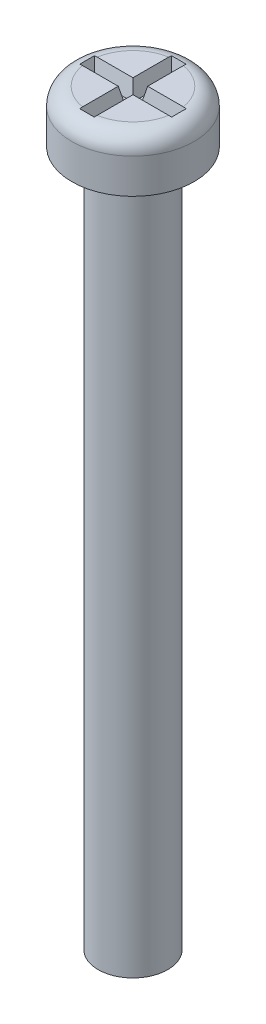
ISO-10303-21;
HEADER;
FILE_DESCRIPTION(('STEP AP214'),'2;1');
FILE_NAME('part.step','',(''),(''),'','','');
FILE_SCHEMA(('AUTOMOTIVE_DESIGN { 1 0 10303 214 1 1 1 1 }'));
ENDSEC;
DATA;
#1=APPLICATION_CONTEXT('core data for automotive mechanical design processes');
#2=APPLICATION_PROTOCOL_DEFINITION('international standard','automotive_design',2000,#1);
#3=PRODUCT_CONTEXT('',#1,'mechanical');
#4=PRODUCT('Part','Part','',(#3));
#5=PRODUCT_RELATED_PRODUCT_CATEGORY('part','',(#4));
#6=PRODUCT_DEFINITION_FORMATION('','',#4);
#7=PRODUCT_DEFINITION_CONTEXT('part definition',#1,'design');
#8=PRODUCT_DEFINITION('design','',#6,#7);
#9=PRODUCT_DEFINITION_SHAPE('','',#8);
#10=(LENGTH_UNIT() NAMED_UNIT(*) SI_UNIT(.MILLI.,.METRE.));
#11=(NAMED_UNIT(*) PLANE_ANGLE_UNIT() SI_UNIT($,.RADIAN.));
#12=(NAMED_UNIT(*) SI_UNIT($,.STERADIAN.) SOLID_ANGLE_UNIT());
#13=UNCERTAINTY_MEASURE_WITH_UNIT(LENGTH_MEASURE(1.E-05),#10,'distance_accuracy_value','');
#14=(GEOMETRIC_REPRESENTATION_CONTEXT(3) GLOBAL_UNCERTAINTY_ASSIGNED_CONTEXT((#13)) GLOBAL_UNIT_ASSIGNED_CONTEXT((#10,
#11,#12)) REPRESENTATION_CONTEXT('',''));
#15=CARTESIAN_POINT('',(0.,0.,0.));
#16=DIRECTION('',(0.,0.,1.));
#17=DIRECTION('',(1.,0.,0.));
#18=AXIS2_PLACEMENT_3D('',#15,#16,#17);
#19=CARTESIAN_POINT('',(0.,43.,0.));
#20=DIRECTION('',(0.,1.,0.));
#21=DIRECTION('',(0.,0.,1.));
#22=AXIS2_PLACEMENT_3D('',#19,#20,#21);
#23=PLANE('',#22);
#24=DIRECTION('',(-1.,0.,0.));
#25=VECTOR('',#24,1.);
#26=CARTESIAN_POINT('',(0.422769915905619,43.,-0.422769915905619));
#27=LINE('',#26,#25);
#28=CARTESIAN_POINT('',(2.47921168886506,43.,-0.422769915905619));
#29=VERTEX_POINT('',#28);
#30=CARTESIAN_POINT('',(0.422769915905619,43.,-0.422769915905619));
#31=VERTEX_POINT('',#30);
#32=EDGE_CURVE('E376',#29,#31,#27,.T.);
#33=ORIENTED_EDGE('',*,*,#32,.F.);
#34=CARTESIAN_POINT('',(0.,43.,0.));
#35=DIRECTION('',(0.,1.,0.));
#36=DIRECTION('',(0.,0.,1.));
#37=AXIS2_PLACEMENT_3D('',#34,#35,#36);
#38=CIRCLE('',#37,2.515);
#39=CARTESIAN_POINT('',(0.422769915905619,43.,-2.47921168886506));
#40=VERTEX_POINT('',#39);
#41=EDGE_CURVE('E262',#29,#40,#38,.T.);
#42=ORIENTED_EDGE('',*,*,#41,.T.);
#43=DIRECTION('',(0.,0.,-1.));
#44=VECTOR('',#43,1.);
#45=CARTESIAN_POINT('',(0.422769915905619,43.,-2.64154947271322));
#46=LINE('',#45,#44);
#47=EDGE_CURVE('E161',#31,#40,#46,.T.);
#48=ORIENTED_EDGE('',*,*,#47,.F.);
#49=EDGE_LOOP('',(#33,#42,#48));
#50=FACE_BOUND('',#49,.T.);
#51=ADVANCED_FACE('F34',(#50),#23,.T.);
#52=DIRECTION('',(0.,0.,1.));
#53=VECTOR('',#52,1.);
#54=CARTESIAN_POINT('',(-0.422769915905619,43.,-0.422769915905619));
#55=LINE('',#54,#53);
#56=CARTESIAN_POINT('',(-0.422769915905619,43.,-2.47921168886506));
#57=VERTEX_POINT('',#56);
#58=CARTESIAN_POINT('',(-0.422769915905619,43.,-0.422769915905619));
#59=VERTEX_POINT('',#58);
#60=EDGE_CURVE('E148',#57,#59,#55,.T.);
#61=ORIENTED_EDGE('',*,*,#60,.F.);
#62=CARTESIAN_POINT('',(0.,43.,0.));
#63=DIRECTION('',(0.,1.,0.));
#64=DIRECTION('',(0.,0.,1.));
#65=AXIS2_PLACEMENT_3D('',#62,#63,#64);
#66=CIRCLE('',#65,2.515);
#67=CARTESIAN_POINT('',(-2.47921168886506,43.,-0.422769915905619));
#68=VERTEX_POINT('',#67);
#69=EDGE_CURVE('E174',#57,#68,#66,.T.);
#70=ORIENTED_EDGE('',*,*,#69,.T.);
#71=DIRECTION('',(-1.,0.,0.));
#72=VECTOR('',#71,1.);
#73=CARTESIAN_POINT('',(-2.64154947271322,43.,-0.422769915905619));
#74=LINE('',#73,#72);
#75=EDGE_CURVE('E160',#59,#68,#74,.T.);
#76=ORIENTED_EDGE('',*,*,#75,.F.);
#77=EDGE_LOOP('',(#61,#70,#76));
#78=FACE_BOUND('',#77,.T.);
#79=ADVANCED_FACE('F173',(#78),#23,.T.);
#80=DIRECTION('',(1.,0.,0.));
#81=VECTOR('',#80,1.);
#82=CARTESIAN_POINT('',(-0.422769915905619,43.,0.422769915905619));
#83=LINE('',#82,#81);
#84=CARTESIAN_POINT('',(-2.47921168886506,43.,0.422769915905619));
#85=VERTEX_POINT('',#84);
#86=CARTESIAN_POINT('',(-0.422769915905619,43.,0.422769915905619));
#87=VERTEX_POINT('',#86);
#88=EDGE_CURVE('E175',#85,#87,#83,.T.);
#89=ORIENTED_EDGE('',*,*,#88,.F.);
#90=CARTESIAN_POINT('',(0.,43.,0.));
#91=DIRECTION('',(0.,1.,0.));
#92=DIRECTION('',(0.,0.,1.));
#93=AXIS2_PLACEMENT_3D('',#90,#91,#92);
#94=CIRCLE('',#93,2.515);
#95=CARTESIAN_POINT('',(-0.422769915905619,43.,2.47921168886506));
#96=VERTEX_POINT('',#95);
#97=EDGE_CURVE('E259',#85,#96,#94,.T.);
#98=ORIENTED_EDGE('',*,*,#97,.T.);
#99=DIRECTION('',(0.,0.,1.));
#100=VECTOR('',#99,1.);
#101=CARTESIAN_POINT('',(-0.422769915905619,43.,2.64154947271322));
#102=LINE('',#101,#100);
#103=EDGE_CURVE('E177',#87,#96,#102,.T.);
#104=ORIENTED_EDGE('',*,*,#103,.F.);
#105=EDGE_LOOP('',(#89,#98,#104));
#106=FACE_BOUND('',#105,.T.);
#107=ADVANCED_FACE('F406',(#106),#23,.T.);
#108=CARTESIAN_POINT('',(0.,40.,0.));
#109=DIRECTION('',(0.,-1.,0.));
#110=DIRECTION('',(0.,0.,-1.));
#111=AXIS2_PLACEMENT_3D('',#108,#109,#110);
#112=CYLINDRICAL_SURFACE('',#111,2.);
#113=CARTESIAN_POINT('',(0.,40.,0.));
#114=DIRECTION('',(0.,1.,0.));
#115=DIRECTION('',(0.,0.,1.));
#116=AXIS2_PLACEMENT_3D('',#113,#114,#115);
#117=CIRCLE('',#116,2.);
#118=CARTESIAN_POINT('',(0.,40.,2.));
#119=VERTEX_POINT('',#118);
#120=EDGE_CURVE('E252',#119,#119,#117,.T.);
#121=ORIENTED_EDGE('',*,*,#120,.F.);
#122=EDGE_LOOP('',(#121));
#123=FACE_BOUND('',#122,.T.);
#124=CARTESIAN_POINT('',(0.,0.,0.));
#125=DIRECTION('',(0.,1.,0.));
#126=DIRECTION('',(0.,0.,1.));
#127=AXIS2_PLACEMENT_3D('',#124,#125,#126);
#128=CIRCLE('',#127,2.);
#129=CARTESIAN_POINT('',(0.,0.,2.));
#130=VERTEX_POINT('',#129);
#131=EDGE_CURVE('E251',#130,#130,#128,.T.);
#132=ORIENTED_EDGE('',*,*,#131,.T.);
#133=EDGE_LOOP('',(#132));
#134=FACE_BOUND('',#133,.T.);
#135=ADVANCED_FACE('F411',(#123,#134),#112,.T.);
#136=CARTESIAN_POINT('',(0.,0.,0.));
#137=DIRECTION('',(0.,1.,0.));
#138=DIRECTION('',(0.,0.,1.));
#139=AXIS2_PLACEMENT_3D('',#136,#137,#138);
#140=PLANE('',#139);
#141=ORIENTED_EDGE('',*,*,#131,.F.);
#142=EDGE_LOOP('',(#141));
#143=FACE_BOUND('',#142,.T.);
#144=ADVANCED_FACE('F416',(#143),#140,.F.);
#145=CARTESIAN_POINT('',(0.,43.,0.));
#146=DIRECTION('',(0.,-1.,0.));
#147=DIRECTION('',(0.,0.,-1.));
#148=AXIS2_PLACEMENT_3D('',#145,#146,#147);
#149=CYLINDRICAL_SURFACE('',#148,3.515);
#150=CARTESIAN_POINT('',(0.,42.,0.));
#151=DIRECTION('',(0.,1.,0.));
#152=DIRECTION('',(0.,0.,1.));
#153=AXIS2_PLACEMENT_3D('',#150,#151,#152);
#154=CIRCLE('',#153,3.515);
#155=CARTESIAN_POINT('',(0.,42.,3.515));
#156=VERTEX_POINT('',#155);
#157=EDGE_CURVE('E11',#156,#156,#154,.F.);
#158=ORIENTED_EDGE('',*,*,#157,.T.);
#159=EDGE_LOOP('',(#158));
#160=FACE_BOUND('',#159,.T.);
#161=CARTESIAN_POINT('',(0.,40.,0.));
#162=DIRECTION('',(0.,1.,0.));
#163=DIRECTION('',(0.,0.,1.));
#164=AXIS2_PLACEMENT_3D('',#161,#162,#163);
#165=CIRCLE('',#164,3.515);
#166=CARTESIAN_POINT('',(0.,40.,3.515));
#167=VERTEX_POINT('',#166);
#168=EDGE_CURVE('E190',#167,#167,#165,.T.);
#169=ORIENTED_EDGE('',*,*,#168,.T.);
#170=EDGE_LOOP('',(#169));
#171=FACE_BOUND('',#170,.T.);
#172=ADVANCED_FACE('F420',(#160,#171),#149,.T.);
#173=DIRECTION('',(0.,0.,-1.));
#174=VECTOR('',#173,1.);
#175=CARTESIAN_POINT('',(0.422769915905619,43.,0.422769915905619));
#176=LINE('',#175,#174);
#177=CARTESIAN_POINT('',(0.422769915905619,43.,2.47921168886506));
#178=VERTEX_POINT('',#177);
#179=CARTESIAN_POINT('',(0.422769915905619,43.,0.422769915905619));
#180=VERTEX_POINT('',#179);
#181=EDGE_CURVE('E183',#178,#180,#176,.T.);
#182=ORIENTED_EDGE('',*,*,#181,.F.);
#183=CARTESIAN_POINT('',(0.,43.,0.));
#184=DIRECTION('',(0.,1.,0.));
#185=DIRECTION('',(0.,0.,1.));
#186=AXIS2_PLACEMENT_3D('',#183,#184,#185);
#187=CIRCLE('',#186,2.515);
#188=CARTESIAN_POINT('',(2.47921168886506,43.,0.422769915905619));
#189=VERTEX_POINT('',#188);
#190=EDGE_CURVE('E255',#178,#189,#187,.T.);
#191=ORIENTED_EDGE('',*,*,#190,.T.);
#192=DIRECTION('',(1.,0.,0.));
#193=VECTOR('',#192,1.);
#194=CARTESIAN_POINT('',(2.64154947271322,43.,0.422769915905619));
#195=LINE('',#194,#193);
#196=EDGE_CURVE('E185',#180,#189,#195,.T.);
#197=ORIENTED_EDGE('',*,*,#196,.F.);
#198=EDGE_LOOP('',(#182,#191,#197));
#199=FACE_BOUND('',#198,.T.);
#200=ADVANCED_FACE('F365',(#199),#23,.T.);
#201=CARTESIAN_POINT('',(0.,40.,0.));
#202=DIRECTION('',(0.,1.,0.));
#203=DIRECTION('',(0.,0.,1.));
#204=AXIS2_PLACEMENT_3D('',#201,#202,#203);
#205=PLANE('',#204);
#206=ORIENTED_EDGE('',*,*,#120,.T.);
#207=EDGE_LOOP('',(#206));
#208=FACE_BOUND('',#207,.T.);
#209=ORIENTED_EDGE('',*,*,#168,.F.);
#210=EDGE_LOOP('',(#209));
#211=FACE_BOUND('',#210,.T.);
#212=ADVANCED_FACE('F419',(#208,#211),#205,.F.);
#213=CARTESIAN_POINT('',(0.422769915905619,43.,-0.422769915905619));
#214=DIRECTION('',(0.,-0.207911690817759,-0.978147600733806));
#215=DIRECTION('',(0.,0.978147600733806,-0.207911690817759));
#216=AXIS2_PLACEMENT_3D('',#213,#214,#215);
#217=PLANE('',#216);
#218=DIRECTION('',(0.203558594952779,0.957667894857973,-0.203558594952779));
#219=VECTOR('',#218,1.);
#220=CARTESIAN_POINT('',(2.60651359835308,42.8351691705733,-0.387734041545471));
#221=LINE('',#220,#219);
#222=CARTESIAN_POINT('',(2.4289929110432,42.,-0.210213354235596));
#223=VERTEX_POINT('',#222);
#224=CARTESIAN_POINT('',(2.63890864587035,42.9875758865211,-0.420129089062744));
#225=VERTEX_POINT('',#224);
#226=EDGE_CURVE('E188',#223,#225,#221,.T.);
#227=ORIENTED_EDGE('',*,*,#226,.T.);
#228=CARTESIAN_POINT('',(2.63890864587035,42.9875758865211,-0.420129089062744));
#229=CARTESIAN_POINT('',(2.61246025382318,42.9917103029364,-0.421007886400498));
#230=CARTESIAN_POINT('',(2.58592795776817,42.9948128539393,-0.421667353974071));
#231=CARTESIAN_POINT('',(2.53269563825816,42.9989542188483,-0.422547628259755));
#232=CARTESIAN_POINT('',(2.50599561531141,42.9999930390051,-0.422768436300485));
#233=CARTESIAN_POINT('',(2.47921168886509,43.0000000000002,-0.422769915905651));
#234=B_SPLINE_CURVE_WITH_KNOTS('',3,(#228,#229,#230,#231,#232,#233),.UNSPECIFIED.,.F.,.F.,(4,2,
4),(0.,0.0801636519091331,0.160327061016982),.UNSPECIFIED.);
#235=EDGE_CURVE('E43',#225,#29,#234,.T.);
#236=ORIENTED_EDGE('',*,*,#235,.T.);
#237=ORIENTED_EDGE('',*,*,#32,.T.);
#238=DIRECTION('',(0.203558594952779,0.957667894857973,-0.203558594952779));
#239=VECTOR('',#238,1.);
#240=CARTESIAN_POINT('',(0.514707491003239,43.4325322839967,-0.514707491003239));
#241=LINE('',#240,#239);
#242=CARTESIAN_POINT('',(0.210213354235596,42.,-0.210213354235596));
#243=VERTEX_POINT('',#242);
#244=EDGE_CURVE('E192',#243,#31,#241,.T.);
#245=ORIENTED_EDGE('',*,*,#244,.F.);
#246=DIRECTION('',(-1.,0.,0.));
#247=VECTOR('',#246,1.);
#248=CARTESIAN_POINT('',(0.,42.,-0.210213354235596));
#249=LINE('',#248,#247);
#250=EDGE_CURVE('E187',#223,#243,#249,.T.);
#251=ORIENTED_EDGE('',*,*,#250,.F.);
#252=EDGE_LOOP('',(#227,#236,#237,#245,#251));
#253=FACE_BOUND('',#252,.T.);
#254=ADVANCED_FACE('F284',(#253),#217,.F.);
#255=CARTESIAN_POINT('',(2.64154947271322,43.,0.422769915905619));
#256=DIRECTION('',(0.978147600733806,-0.207911690817759,0.));
#257=DIRECTION('',(0.207911690817759,0.978147600733806,0.));
#258=AXIS2_PLACEMENT_3D('',#255,#256,#257);
#259=PLANE('',#258);
#260=DIRECTION('',(0.203558594952779,0.957667894857973,0.203558594952779));
#261=VECTOR('',#260,1.);
#262=CARTESIAN_POINT('',(2.64154947271322,43.,0.422769915905619));
#263=LINE('',#262,#261);
#264=CARTESIAN_POINT('',(2.4289929110432,42.,0.210213354235596));
#265=VERTEX_POINT('',#264);
#266=CARTESIAN_POINT('',(2.63890864587035,42.9875758865211,0.420129089062743));
#267=VERTEX_POINT('',#266);
#268=EDGE_CURVE('E191',#265,#267,#263,.T.);
#269=ORIENTED_EDGE('',*,*,#268,.T.);
#270=CARTESIAN_POINT('',(2.63890864587035,42.9875758865211,0.420129089062743));
#271=CARTESIAN_POINT('',(2.63926052612753,42.989231352974,0.350115794791615));
#272=CARTESIAN_POINT('',(2.63950472425311,42.9903802148282,0.280093037473653));
#273=CARTESIAN_POINT('',(2.63981715218977,42.9918500727061,0.140046852645141));
#274=CARTESIAN_POINT('',(2.6398854040906,42.9921711726538,0.0700234263225704));
#275=CARTESIAN_POINT('',(2.6398854040906,42.9921711726538,-0.070023426322571));
#276=CARTESIAN_POINT('',(2.63981715218977,42.9918500727061,-0.140046852645142));
#277=CARTESIAN_POINT('',(2.63950472425311,42.9903802148282,-0.280093037473653));
#278=CARTESIAN_POINT('',(2.63926052612753,42.989231352974,-0.350115794791616));
#279=CARTESIAN_POINT('',(2.63890864587035,42.9875758865211,-0.420129089062744));
#280=B_SPLINE_CURVE_WITH_KNOTS('',3,(#270,#271,#272,#273,#274,#275,#276,#277,#278,#279),
.UNSPECIFIED.,.F.,.F.,(4,2,2,2,4),(0.,0.210094701314381,0.420163024312075,0.630231347309768,
0.840326048624149),.UNSPECIFIED.);
#281=EDGE_CURVE('E50',#267,#225,#280,.T.);
#282=ORIENTED_EDGE('',*,*,#281,.T.);
#283=ORIENTED_EDGE('',*,*,#226,.F.);
#284=DIRECTION('',(0.,0.,-1.));
#285=VECTOR('',#284,1.);
#286=CARTESIAN_POINT('',(2.4289929110432,42.,0.));
#287=LINE('',#286,#285);
#288=EDGE_CURVE('E196',#265,#223,#287,.T.);
#289=ORIENTED_EDGE('',*,*,#288,.F.);
#290=EDGE_LOOP('',(#269,#282,#283,#289));
#291=FACE_BOUND('',#290,.T.);
#292=ADVANCED_FACE('F361',(#291),#259,.F.);
#293=CARTESIAN_POINT('',(2.64154947271322,43.,0.422769915905619));
#294=DIRECTION('',(0.,-0.207911690817759,0.978147600733806));
#295=DIRECTION('',(0.,-0.978147600733806,-0.207911690817759));
#296=AXIS2_PLACEMENT_3D('',#293,#294,#295);
#297=PLANE('',#296);
#298=ORIENTED_EDGE('',*,*,#196,.T.);
#299=CARTESIAN_POINT('',(2.47921168886506,43.,0.422769915905619));
#300=CARTESIAN_POINT('',(2.5059956153114,42.9999930390051,0.422768436300468));
#301=CARTESIAN_POINT('',(2.53269563825815,42.9989542188483,0.422547628259749));
#302=CARTESIAN_POINT('',(2.58592795776817,42.9948128539393,0.421667353974077));
#303=CARTESIAN_POINT('',(2.61246025382318,42.9917103029365,0.421007886400505));
#304=CARTESIAN_POINT('',(2.63890864587035,42.9875758865211,0.420129089062746));
#305=B_SPLINE_CURVE_WITH_KNOTS('',3,(#299,#300,#301,#302,#303,#304),.UNSPECIFIED.,.F.,.F.,(4,2,
4),(0.,0.0801634091078601,0.160327061016998),.UNSPECIFIED.);
#306=EDGE_CURVE('E58',#189,#267,#305,.T.);
#307=ORIENTED_EDGE('',*,*,#306,.T.);
#308=ORIENTED_EDGE('',*,*,#268,.F.);
#309=DIRECTION('',(1.,0.,0.));
#310=VECTOR('',#309,1.);
#311=CARTESIAN_POINT('',(0.,42.,0.210213354235596));
#312=LINE('',#311,#310);
#313=CARTESIAN_POINT('',(0.210213354235596,42.,0.210213354235596));
#314=VERTEX_POINT('',#313);
#315=EDGE_CURVE('E223',#314,#265,#312,.T.);
#316=ORIENTED_EDGE('',*,*,#315,.F.);
#317=DIRECTION('',(0.203558594952779,0.957667894857973,0.203558594952779));
#318=VECTOR('',#317,1.);
#319=CARTESIAN_POINT('',(0.514707491003239,43.4325322839967,0.514707491003239));
#320=LINE('',#319,#318);
#321=EDGE_CURVE('E214',#314,#180,#320,.T.);
#322=ORIENTED_EDGE('',*,*,#321,.T.);
#323=EDGE_LOOP('',(#298,#307,#308,#316,#322));
#324=FACE_BOUND('',#323,.T.);
#325=ADVANCED_FACE('F356',(#324),#297,.F.);
#326=CARTESIAN_POINT('',(0.422769915905619,43.,0.422769915905619));
#327=DIRECTION('',(0.978147600733806,-0.207911690817759,0.));
#328=DIRECTION('',(0.207911690817759,0.978147600733806,0.));
#329=AXIS2_PLACEMENT_3D('',#326,#327,#328);
#330=PLANE('',#329);
#331=DIRECTION('',(0.203558594952779,0.957667894857973,0.203558594952779));
#332=VECTOR('',#331,1.);
#333=CARTESIAN_POINT('',(0.387734041545471,42.8351691705733,2.60651359835307));
#334=LINE('',#333,#332);
#335=CARTESIAN_POINT('',(0.210213354235596,42.,2.4289929110432));
#336=VERTEX_POINT('',#335);
#337=CARTESIAN_POINT('',(0.420129089062744,42.9875758865211,2.63890864587035));
#338=VERTEX_POINT('',#337);
#339=EDGE_CURVE('E211',#336,#338,#334,.T.);
#340=ORIENTED_EDGE('',*,*,#339,.T.);
#341=CARTESIAN_POINT('',(0.420129089062744,42.9875758865211,2.63890864587035));
#342=CARTESIAN_POINT('',(0.421007886400498,42.9917103029364,2.61246025382318));
#343=CARTESIAN_POINT('',(0.421667353974071,42.9948128539393,2.58592795776817));
#344=CARTESIAN_POINT('',(0.422547628259755,42.9989542188483,2.53269563825816));
#345=CARTESIAN_POINT('',(0.422768436300485,42.9999930390051,2.50599561531141));
#346=CARTESIAN_POINT('',(0.422769915905651,43.0000000000002,2.47921168886509));
#347=B_SPLINE_CURVE_WITH_KNOTS('',3,(#341,#342,#343,#344,#345,#346),.UNSPECIFIED.,.F.,.F.,(4,2,
4),(0.,0.0801636519091327,0.160327061016981),.UNSPECIFIED.);
#348=EDGE_CURVE('E343',#338,#178,#347,.T.);
#349=ORIENTED_EDGE('',*,*,#348,.T.);
#350=ORIENTED_EDGE('',*,*,#181,.T.);
#351=ORIENTED_EDGE('',*,*,#321,.F.);
#352=DIRECTION('',(0.,0.,-1.));
#353=VECTOR('',#352,1.);
#354=CARTESIAN_POINT('',(0.210213354235596,42.,0.));
#355=LINE('',#354,#353);
#356=EDGE_CURVE('E226',#336,#314,#355,.T.);
#357=ORIENTED_EDGE('',*,*,#356,.F.);
#358=EDGE_LOOP('',(#340,#349,#350,#351,#357));
#359=FACE_BOUND('',#358,.T.);
#360=ADVANCED_FACE('F353',(#359),#330,.F.);
#361=CARTESIAN_POINT('',(-0.422769915905619,43.,2.64154947271322));
#362=DIRECTION('',(0.,-0.207911690817759,0.978147600733806));
#363=DIRECTION('',(0.,-0.978147600733806,-0.207911690817759));
#364=AXIS2_PLACEMENT_3D('',#361,#362,#363);
#365=PLANE('',#364);
#366=DIRECTION('',(-0.203558594952779,0.957667894857973,0.203558594952779));
#367=VECTOR('',#366,1.);
#368=CARTESIAN_POINT('',(-0.422769915905619,43.,2.64154947271322));
#369=LINE('',#368,#367);
#370=CARTESIAN_POINT('',(-0.210213354235597,42.,2.4289929110432));
#371=VERTEX_POINT('',#370);
#372=CARTESIAN_POINT('',(-0.420129089062743,42.9875758865211,2.63890864587035));
#373=VERTEX_POINT('',#372);
#374=EDGE_CURVE('E208',#371,#373,#369,.T.);
#375=ORIENTED_EDGE('',*,*,#374,.T.);
#376=CARTESIAN_POINT('',(-0.420129089062743,42.9875758865211,2.63890864587035));
#377=CARTESIAN_POINT('',(-0.350115794791616,42.989231352974,2.63926052612753));
#378=CARTESIAN_POINT('',(-0.280093037473653,42.9903802148282,2.63950472425311));
#379=CARTESIAN_POINT('',(-0.140046852645141,42.9918500727061,2.63981715218977));
#380=CARTESIAN_POINT('',(-0.0700234263225707,42.9921711726538,2.6398854040906));
#381=CARTESIAN_POINT('',(0.0700234263225709,42.9921711726538,2.6398854040906));
#382=CARTESIAN_POINT('',(0.140046852645142,42.9918500727061,2.63981715218977));
#383=CARTESIAN_POINT('',(0.280093037473653,42.9903802148282,2.63950472425311));
#384=CARTESIAN_POINT('',(0.350115794791616,42.989231352974,2.63926052612753));
#385=CARTESIAN_POINT('',(0.420129089062744,42.9875758865211,2.63890864587035));
#386=B_SPLINE_CURVE_WITH_KNOTS('',3,(#376,#377,#378,#379,#380,#381,#382,#383,#384,#385),
.UNSPECIFIED.,.F.,.F.,(4,2,2,2,4),(0.,0.210094701314381,0.420163024312075,0.630231347309769,
0.84032604862415),.UNSPECIFIED.);
#387=EDGE_CURVE('E338',#373,#338,#386,.T.);
#388=ORIENTED_EDGE('',*,*,#387,.T.);
#389=ORIENTED_EDGE('',*,*,#339,.F.);
#390=DIRECTION('',(1.,0.,0.));
#391=VECTOR('',#390,1.);
#392=CARTESIAN_POINT('',(0.,42.,2.4289929110432));
#393=LINE('',#392,#391);
#394=EDGE_CURVE('E229',#371,#336,#393,.T.);
#395=ORIENTED_EDGE('',*,*,#394,.F.);
#396=EDGE_LOOP('',(#375,#388,#389,#395));
#397=FACE_BOUND('',#396,.T.);
#398=ADVANCED_FACE('F329',(#397),#365,.F.);
#399=CARTESIAN_POINT('',(-0.422769915905619,43.,2.64154947271322));
#400=DIRECTION('',(-0.978147600733806,-0.207911690817759,0.));
#401=DIRECTION('',(0.207911690817759,-0.978147600733806,0.));
#402=AXIS2_PLACEMENT_3D('',#399,#400,#401);
#403=PLANE('',#402);
#404=ORIENTED_EDGE('',*,*,#103,.T.);
#405=CARTESIAN_POINT('',(-0.422769915905619,43.,2.47921168886506));
#406=CARTESIAN_POINT('',(-0.422768436300468,42.9999930390051,2.5059956153114));
#407=CARTESIAN_POINT('',(-0.422547628259749,42.9989542188483,2.53269563825815));
#408=CARTESIAN_POINT('',(-0.421667353974077,42.9948128539393,2.58592795776817));
#409=CARTESIAN_POINT('',(-0.421007886400505,42.9917103029365,2.61246025382318));
#410=CARTESIAN_POINT('',(-0.420129089062746,42.9875758865211,2.63890864587035));
#411=B_SPLINE_CURVE_WITH_KNOTS('',3,(#405,#406,#407,#408,#409,#410),.UNSPECIFIED.,.F.,.F.,(4,2,
4),(0.,0.0801634091078601,0.160327061016998),.UNSPECIFIED.);
#412=EDGE_CURVE('E333',#96,#373,#411,.T.);
#413=ORIENTED_EDGE('',*,*,#412,.T.);
#414=ORIENTED_EDGE('',*,*,#374,.F.);
#415=DIRECTION('',(0.,0.,1.));
#416=VECTOR('',#415,1.);
#417=CARTESIAN_POINT('',(-0.210213354235596,42.,0.));
#418=LINE('',#417,#416);
#419=CARTESIAN_POINT('',(-0.210213354235596,42.,0.210213354235596));
#420=VERTEX_POINT('',#419);
#421=EDGE_CURVE('E232',#420,#371,#418,.T.);
#422=ORIENTED_EDGE('',*,*,#421,.F.);
#423=DIRECTION('',(-0.203558594952779,0.957667894857973,0.203558594952779));
#424=VECTOR('',#423,1.);
#425=CARTESIAN_POINT('',(-0.514707491003239,43.4325322839967,0.514707491003239));
#426=LINE('',#425,#424);
#427=EDGE_CURVE('E205',#420,#87,#426,.T.);
#428=ORIENTED_EDGE('',*,*,#427,.T.);
#429=EDGE_LOOP('',(#404,#413,#414,#422,#428));
#430=FACE_BOUND('',#429,.T.);
#431=ADVANCED_FACE('F324',(#430),#403,.F.);
#432=CARTESIAN_POINT('',(-0.422769915905619,43.,0.422769915905619));
#433=DIRECTION('',(0.,-0.207911690817759,0.978147600733806));
#434=DIRECTION('',(0.,-0.978147600733806,-0.207911690817759));
#435=AXIS2_PLACEMENT_3D('',#432,#433,#434);
#436=PLANE('',#435);
#437=DIRECTION('',(-0.203558594952779,0.957667894857973,0.203558594952779));
#438=VECTOR('',#437,1.);
#439=CARTESIAN_POINT('',(-2.64154947271322,43.,0.422769915905619));
#440=LINE('',#439,#438);
#441=CARTESIAN_POINT('',(-2.4289929110432,42.,0.210213354235596));
#442=VERTEX_POINT('',#441);
#443=CARTESIAN_POINT('',(-2.63890864587035,42.9875758865211,0.420129089062743));
#444=VERTEX_POINT('',#443);
#445=EDGE_CURVE('E202',#442,#444,#440,.T.);
#446=ORIENTED_EDGE('',*,*,#445,.T.);
#447=CARTESIAN_POINT('',(-2.63890864587035,42.9875758865211,0.420129089062743));
#448=CARTESIAN_POINT('',(-2.61246025382318,42.9917103029364,0.421007886400498));
#449=CARTESIAN_POINT('',(-2.58592795776817,42.9948128539393,0.421667353974071));
#450=CARTESIAN_POINT('',(-2.53269563825816,42.9989542188483,0.422547628259755));
#451=CARTESIAN_POINT('',(-2.50599561531141,42.9999930390051,0.422768436300485));
#452=CARTESIAN_POINT('',(-2.47921168886509,43.0000000000002,0.422769915905651));
#453=B_SPLINE_CURVE_WITH_KNOTS('',3,(#447,#448,#449,#450,#451,#452),.UNSPECIFIED.,.F.,.F.,(4,2,
4),(0.,0.0801636519091327,0.160327061016981),.UNSPECIFIED.);
#454=EDGE_CURVE('E310',#444,#85,#453,.T.);
#455=ORIENTED_EDGE('',*,*,#454,.T.);
#456=ORIENTED_EDGE('',*,*,#88,.T.);
#457=ORIENTED_EDGE('',*,*,#427,.F.);
#458=DIRECTION('',(1.,0.,0.));
#459=VECTOR('',#458,1.);
#460=CARTESIAN_POINT('',(0.,42.,0.210213354235596));
#461=LINE('',#460,#459);
#462=EDGE_CURVE('E235',#442,#420,#461,.T.);
#463=ORIENTED_EDGE('',*,*,#462,.F.);
#464=EDGE_LOOP('',(#446,#455,#456,#457,#463));
#465=FACE_BOUND('',#464,.T.);
#466=ADVANCED_FACE('F319',(#465),#436,.F.);
#467=CARTESIAN_POINT('',(-2.64154947271322,43.,0.422769915905619));
#468=DIRECTION('',(-0.978147600733806,-0.207911690817759,0.));
#469=DIRECTION('',(0.207911690817759,-0.978147600733806,0.));
#470=AXIS2_PLACEMENT_3D('',#467,#468,#469);
#471=PLANE('',#470);
#472=DIRECTION('',(-0.203558594952779,0.957667894857973,-0.203558594952779));
#473=VECTOR('',#472,1.);
#474=CARTESIAN_POINT('',(-2.64154947271322,43.,-0.422769915905619));
#475=LINE('',#474,#473);
#476=CARTESIAN_POINT('',(-2.4289929110432,42.,-0.210213354235596));
#477=VERTEX_POINT('',#476);
#478=CARTESIAN_POINT('',(-2.63890864587035,42.9875758865211,-0.420129089062743));
#479=VERTEX_POINT('',#478);
#480=EDGE_CURVE('E170',#477,#479,#475,.T.);
#481=ORIENTED_EDGE('',*,*,#480,.T.);
#482=CARTESIAN_POINT('',(-2.63890864587035,42.9875758865211,-0.420129089062743));
#483=CARTESIAN_POINT('',(-2.63926052612753,42.989231352974,-0.350115794791615));
#484=CARTESIAN_POINT('',(-2.63950472425311,42.9903802148282,-0.280093037473653));
#485=CARTESIAN_POINT('',(-2.63981715218977,42.9918500727061,-0.140046852645141));
#486=CARTESIAN_POINT('',(-2.6398854040906,42.9921711726538,-0.0700234263225706));
#487=CARTESIAN_POINT('',(-2.6398854040906,42.9921711726538,0.0700234263225706));
#488=CARTESIAN_POINT('',(-2.63981715218977,42.9918500727061,0.140046852645141));
#489=CARTESIAN_POINT('',(-2.63950472425311,42.9903802148282,0.280093037473653));
#490=CARTESIAN_POINT('',(-2.63926052612753,42.989231352974,0.350115794791615));
#491=CARTESIAN_POINT('',(-2.63890864587035,42.9875758865211,0.420129089062743));
#492=B_SPLINE_CURVE_WITH_KNOTS('',3,(#482,#483,#484,#485,#486,#487,#488,#489,#490,#491),
.UNSPECIFIED.,.F.,.F.,(4,2,2,2,4),(0.,0.210094701314381,0.420163024312074,0.630231347309768,
0.840326048624149),.UNSPECIFIED.);
#493=EDGE_CURVE('E305',#479,#444,#492,.T.);
#494=ORIENTED_EDGE('',*,*,#493,.T.);
#495=ORIENTED_EDGE('',*,*,#445,.F.);
#496=DIRECTION('',(0.,0.,1.));
#497=VECTOR('',#496,1.);
#498=CARTESIAN_POINT('',(-2.4289929110432,42.,0.));
#499=LINE('',#498,#497);
#500=EDGE_CURVE('E238',#477,#442,#499,.T.);
#501=ORIENTED_EDGE('',*,*,#500,.F.);
#502=EDGE_LOOP('',(#481,#494,#495,#501));
#503=FACE_BOUND('',#502,.T.);
#504=ADVANCED_FACE('F316',(#503),#471,.F.);
#505=CARTESIAN_POINT('',(-2.64154947271322,43.,-0.422769915905619));
#506=DIRECTION('',(0.,-0.207911690817759,-0.978147600733806));
#507=DIRECTION('',(0.,0.978147600733806,-0.207911690817759));
#508=AXIS2_PLACEMENT_3D('',#505,#506,#507);
#509=PLANE('',#508);
#510=ORIENTED_EDGE('',*,*,#75,.T.);
#511=CARTESIAN_POINT('',(-2.47921168886506,43.,-0.422769915905619));
#512=CARTESIAN_POINT('',(-2.5059956153114,42.9999930390051,-0.422768436300468));
#513=CARTESIAN_POINT('',(-2.53269563825815,42.9989542188483,-0.422547628259749));
#514=CARTESIAN_POINT('',(-2.58592795776817,42.9948128539393,-0.421667353974077));
#515=CARTESIAN_POINT('',(-2.61246025382318,42.9917103029365,-0.421007886400505));
#516=CARTESIAN_POINT('',(-2.63890864587035,42.9875758865211,-0.420129089062746));
#517=B_SPLINE_CURVE_WITH_KNOTS('',3,(#511,#512,#513,#514,#515,#516),.UNSPECIFIED.,.F.,.F.,(4,2,
4),(0.,0.0801634091078601,0.160327061016998),.UNSPECIFIED.);
#518=EDGE_CURVE('E300',#68,#479,#517,.T.);
#519=ORIENTED_EDGE('',*,*,#518,.T.);
#520=ORIENTED_EDGE('',*,*,#480,.F.);
#521=DIRECTION('',(-1.,0.,0.));
#522=VECTOR('',#521,1.);
#523=CARTESIAN_POINT('',(0.,42.,-0.210213354235596));
#524=LINE('',#523,#522);
#525=CARTESIAN_POINT('',(-0.210213354235596,42.,-0.210213354235596));
#526=VERTEX_POINT('',#525);
#527=EDGE_CURVE('E168',#526,#477,#524,.T.);
#528=ORIENTED_EDGE('',*,*,#527,.F.);
#529=DIRECTION('',(-0.203558594952779,0.957667894857973,-0.203558594952779));
#530=VECTOR('',#529,1.);
#531=CARTESIAN_POINT('',(-0.514707491003239,43.4325322839967,-0.514707491003239));
#532=LINE('',#531,#530);
#533=EDGE_CURVE('E153',#526,#59,#532,.T.);
#534=ORIENTED_EDGE('',*,*,#533,.T.);
#535=EDGE_LOOP('',(#510,#519,#520,#528,#534));
#536=FACE_BOUND('',#535,.T.);
#537=ADVANCED_FACE('F165',(#536),#509,.F.);
#538=CARTESIAN_POINT('',(-0.422769915905619,43.,-0.422769915905619));
#539=DIRECTION('',(-0.978147600733806,-0.207911690817759,0.));
#540=DIRECTION('',(0.207911690817759,-0.978147600733806,0.));
#541=AXIS2_PLACEMENT_3D('',#538,#539,#540);
#542=PLANE('',#541);
#543=DIRECTION('',(-0.203558594952779,0.957667894857973,-0.203558594952779));
#544=VECTOR('',#543,1.);
#545=CARTESIAN_POINT('',(-0.422769915905619,43.,-2.64154947271322));
#546=LINE('',#545,#544);
#547=CARTESIAN_POINT('',(-0.210213354235597,42.,-2.4289929110432));
#548=VERTEX_POINT('',#547);
#549=CARTESIAN_POINT('',(-0.420129089062743,42.9875758865211,-2.63890864587035));
#550=VERTEX_POINT('',#549);
#551=EDGE_CURVE('E171',#548,#550,#546,.T.);
#552=ORIENTED_EDGE('',*,*,#551,.T.);
#553=CARTESIAN_POINT('',(-0.420129089062743,42.9875758865211,-2.63890864587035));
#554=CARTESIAN_POINT('',(-0.421007886400498,42.9917103029364,-2.61246025382318));
#555=CARTESIAN_POINT('',(-0.421667353974071,42.9948128539393,-2.58592795776817));
#556=CARTESIAN_POINT('',(-0.422547628259755,42.9989542188483,-2.53269563825816));
#557=CARTESIAN_POINT('',(-0.422768436300485,42.9999930390051,-2.50599561531141));
#558=CARTESIAN_POINT('',(-0.422769915905652,43.0000000000002,-2.47921168886509));
#559=B_SPLINE_CURVE_WITH_KNOTS('',3,(#553,#554,#555,#556,#557,#558),.UNSPECIFIED.,.F.,.F.,(4,2,
4),(0.,0.0801636519091335,0.160327061016982),.UNSPECIFIED.);
#560=EDGE_CURVE('E156',#550,#57,#559,.T.);
#561=ORIENTED_EDGE('',*,*,#560,.T.);
#562=ORIENTED_EDGE('',*,*,#60,.T.);
#563=ORIENTED_EDGE('',*,*,#533,.F.);
#564=DIRECTION('',(0.,0.,1.));
#565=VECTOR('',#564,1.);
#566=CARTESIAN_POINT('',(-0.210213354235596,42.,0.));
#567=LINE('',#566,#565);
#568=EDGE_CURVE('E242',#548,#526,#567,.T.);
#569=ORIENTED_EDGE('',*,*,#568,.F.);
#570=EDGE_LOOP('',(#552,#561,#562,#563,#569));
#571=FACE_BOUND('',#570,.T.);
#572=ADVANCED_FACE('F151',(#571),#542,.F.);
#573=CARTESIAN_POINT('',(-0.422769915905619,43.,-2.64154947271322));
#574=DIRECTION('',(0.,-0.207911690817759,-0.978147600733806));
#575=DIRECTION('',(0.,0.978147600733806,-0.207911690817759));
#576=AXIS2_PLACEMENT_3D('',#573,#574,#575);
#577=PLANE('',#576);
#578=DIRECTION('',(0.203558594952779,0.957667894857973,-0.203558594952779));
#579=VECTOR('',#578,1.);
#580=CARTESIAN_POINT('',(0.422769915905619,43.,-2.64154947271322));
#581=LINE('',#580,#579);
#582=CARTESIAN_POINT('',(0.210213354235596,42.,-2.4289929110432));
#583=VERTEX_POINT('',#582);
#584=CARTESIAN_POINT('',(0.420129089062743,42.9875758865211,-2.63890864587035));
#585=VERTEX_POINT('',#584);
#586=EDGE_CURVE('E195',#583,#585,#581,.T.);
#587=ORIENTED_EDGE('',*,*,#586,.T.);
#588=CARTESIAN_POINT('',(0.420129089062743,42.9875758865211,-2.63890864587035));
#589=CARTESIAN_POINT('',(0.350115794791615,42.989231352974,-2.63926052612753));
#590=CARTESIAN_POINT('',(0.280093037473652,42.9903802148282,-2.63950472425311));
#591=CARTESIAN_POINT('',(0.140046852645141,42.9918500727061,-2.63981715218977));
#592=CARTESIAN_POINT('',(0.0700234263225705,42.9921711726538,-2.6398854040906));
#593=CARTESIAN_POINT('',(-0.0700234263225708,42.9921711726538,-2.6398854040906));
#594=CARTESIAN_POINT('',(-0.140046852645141,42.9918500727061,-2.63981715218977));
#595=CARTESIAN_POINT('',(-0.280093037473653,42.9903802148282,-2.63950472425311));
#596=CARTESIAN_POINT('',(-0.350115794791616,42.989231352974,-2.63926052612753));
#597=CARTESIAN_POINT('',(-0.420129089062743,42.9875758865211,-2.63890864587035));
#598=B_SPLINE_CURVE_WITH_KNOTS('',3,(#588,#589,#590,#591,#592,#593,#594,#595,#596,#597),
.UNSPECIFIED.,.F.,.F.,(4,2,2,2,4),(0.,0.210094701314381,0.420163024312074,0.630231347309768,
0.840326048624149),.UNSPECIFIED.);
#599=EDGE_CURVE('E271',#585,#550,#598,.T.);
#600=ORIENTED_EDGE('',*,*,#599,.T.);
#601=ORIENTED_EDGE('',*,*,#551,.F.);
#602=DIRECTION('',(-1.,0.,0.));
#603=VECTOR('',#602,1.);
#604=CARTESIAN_POINT('',(0.,42.,-2.4289929110432));
#605=LINE('',#604,#603);
#606=EDGE_CURVE('E244',#583,#548,#605,.T.);
#607=ORIENTED_EDGE('',*,*,#606,.F.);
#608=EDGE_LOOP('',(#587,#600,#601,#607));
#609=FACE_BOUND('',#608,.T.);
#610=ADVANCED_FACE('F282',(#609),#577,.F.);
#611=CARTESIAN_POINT('',(0.422769915905619,43.,-2.64154947271322));
#612=DIRECTION('',(0.978147600733806,-0.207911690817759,0.));
#613=DIRECTION('',(0.207911690817759,0.978147600733806,0.));
#614=AXIS2_PLACEMENT_3D('',#611,#612,#613);
#615=PLANE('',#614);
#616=ORIENTED_EDGE('',*,*,#47,.T.);
#617=CARTESIAN_POINT('',(0.422769915905619,43.,-2.47921168886506));
#618=CARTESIAN_POINT('',(0.422768436300468,42.9999930390051,-2.5059956153114));
#619=CARTESIAN_POINT('',(0.422547628259749,42.9989542188483,-2.53269563825815));
#620=CARTESIAN_POINT('',(0.421667353974077,42.9948128539393,-2.58592795776817));
#621=CARTESIAN_POINT('',(0.421007886400505,42.9917103029365,-2.61246025382318));
#622=CARTESIAN_POINT('',(0.420129089062746,42.9875758865211,-2.63890864587035));
#623=B_SPLINE_CURVE_WITH_KNOTS('',3,(#617,#618,#619,#620,#621,#622),.UNSPECIFIED.,.F.,.F.,(4,2,
4),(0.,0.0801634091078609,0.160327061016999),.UNSPECIFIED.);
#624=EDGE_CURVE('E265',#40,#585,#623,.T.);
#625=ORIENTED_EDGE('',*,*,#624,.T.);
#626=ORIENTED_EDGE('',*,*,#586,.F.);
#627=DIRECTION('',(0.,0.,-1.));
#628=VECTOR('',#627,1.);
#629=CARTESIAN_POINT('',(0.210213354235596,42.,0.));
#630=LINE('',#629,#628);
#631=EDGE_CURVE('E220',#243,#583,#630,.T.);
#632=ORIENTED_EDGE('',*,*,#631,.F.);
#633=ORIENTED_EDGE('',*,*,#244,.T.);
#634=EDGE_LOOP('',(#616,#625,#626,#632,#633));
#635=FACE_BOUND('',#634,.T.);
#636=ADVANCED_FACE('F277',(#635),#615,.F.);
#637=CARTESIAN_POINT('',(0.,42.,0.));
#638=DIRECTION('',(0.,1.,0.));
#639=DIRECTION('',(0.,0.,1.));
#640=AXIS2_PLACEMENT_3D('',#637,#638,#639);
#641=PLANE('',#640);
#642=ORIENTED_EDGE('',*,*,#250,.T.);
#643=ORIENTED_EDGE('',*,*,#631,.T.);
#644=ORIENTED_EDGE('',*,*,#606,.T.);
#645=ORIENTED_EDGE('',*,*,#568,.T.);
#646=ORIENTED_EDGE('',*,*,#527,.T.);
#647=ORIENTED_EDGE('',*,*,#500,.T.);
#648=ORIENTED_EDGE('',*,*,#462,.T.);
#649=ORIENTED_EDGE('',*,*,#421,.T.);
#650=ORIENTED_EDGE('',*,*,#394,.T.);
#651=ORIENTED_EDGE('',*,*,#356,.T.);
#652=ORIENTED_EDGE('',*,*,#315,.T.);
#653=ORIENTED_EDGE('',*,*,#288,.T.);
#654=EDGE_LOOP('',(#642,#643,#644,#645,#646,#647,#648,#649,#650,#651,#652,#653));
#655=FACE_BOUND('',#654,.T.);
#656=ADVANCED_FACE('F281',(#655),#641,.T.);
#657=CARTESIAN_POINT('',(0.,42.,0.));
#658=DIRECTION('',(0.,1.,0.));
#659=DIRECTION('',(0.,0.,1.));
#660=AXIS2_PLACEMENT_3D('',#657,#658,#659);
#661=TOROIDAL_SURFACE('',#660,2.515,1.);
#662=ORIENTED_EDGE('',*,*,#157,.F.);
#663=EDGE_LOOP('',(#662));
#664=FACE_BOUND('',#663,.T.);
#665=ORIENTED_EDGE('',*,*,#624,.F.);
#666=ORIENTED_EDGE('',*,*,#41,.F.);
#667=ORIENTED_EDGE('',*,*,#235,.F.);
#668=ORIENTED_EDGE('',*,*,#281,.F.);
#669=ORIENTED_EDGE('',*,*,#306,.F.);
#670=ORIENTED_EDGE('',*,*,#190,.F.);
#671=ORIENTED_EDGE('',*,*,#348,.F.);
#672=ORIENTED_EDGE('',*,*,#387,.F.);
#673=ORIENTED_EDGE('',*,*,#412,.F.);
#674=ORIENTED_EDGE('',*,*,#97,.F.);
#675=ORIENTED_EDGE('',*,*,#454,.F.);
#676=ORIENTED_EDGE('',*,*,#493,.F.);
#677=ORIENTED_EDGE('',*,*,#518,.F.);
#678=ORIENTED_EDGE('',*,*,#69,.F.);
#679=ORIENTED_EDGE('',*,*,#560,.F.);
#680=ORIENTED_EDGE('',*,*,#599,.F.);
#681=EDGE_LOOP('',(#665,#666,#667,#668,#669,#670,#671,#672,#673,#674,#675,#676,#677,#678,#679,#680));
#682=FACE_BOUND('',#681,.T.);
#683=ADVANCED_FACE('F36',(#664,#682),#661,.T.);
#684=CLOSED_SHELL('',(#51,#79,#107,#135,#144,#172,#200,#212,#254,#292,#325,#360,#398,#431,#466,
#504,#537,#572,#610,#636,#656,#683));
#685=MANIFOLD_SOLID_BREP('B2',#684);
#686=ADVANCED_BREP_SHAPE_REPRESENTATION('',(#18,#685),#14);
#687=SHAPE_DEFINITION_REPRESENTATION(#9,#686);
ENDSEC;
END-ISO-10303-21;
